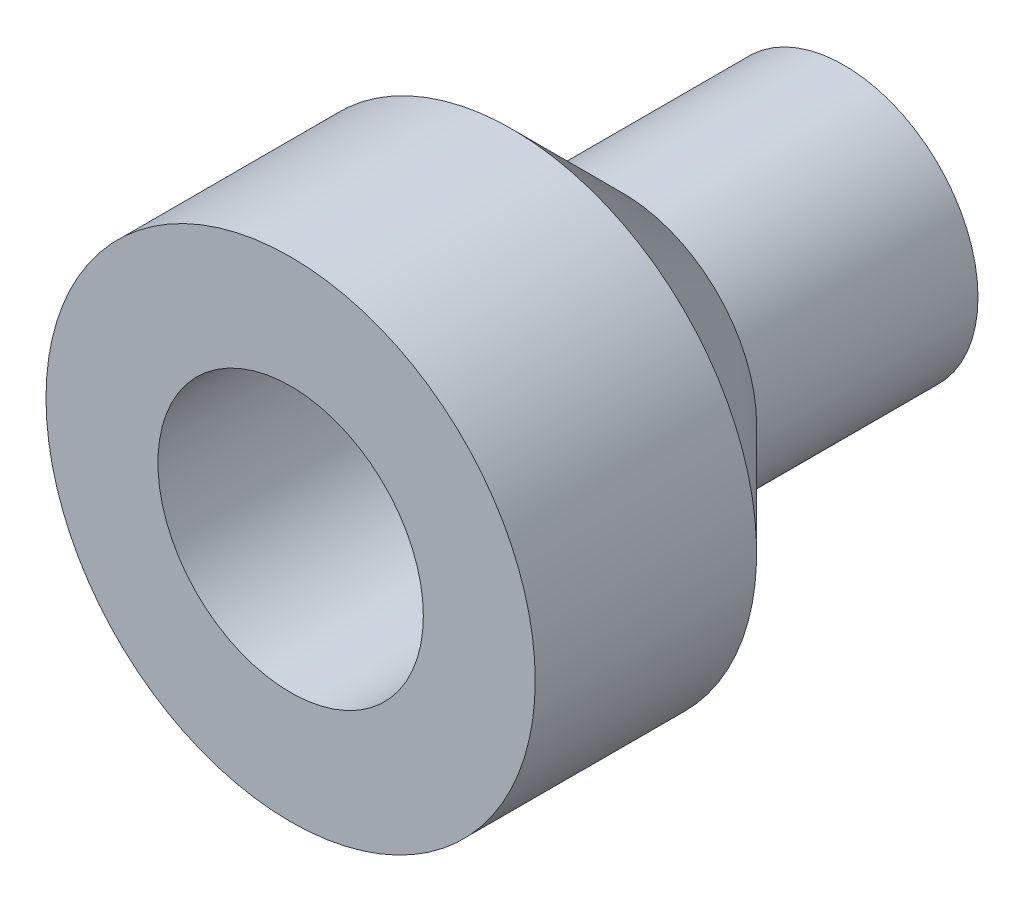
ISO-10303-21;
HEADER;
FILE_DESCRIPTION(('STEP AP214'),'2;1');
FILE_NAME('part.step','',(''),(''),'','','');
FILE_SCHEMA(('AUTOMOTIVE_DESIGN { 1 0 10303 214 1 1 1 1 }'));
ENDSEC;
DATA;
#1=APPLICATION_CONTEXT('core data for automotive mechanical design processes');
#2=APPLICATION_PROTOCOL_DEFINITION('international standard','automotive_design',2000,#1);
#3=PRODUCT_CONTEXT('',#1,'mechanical');
#4=PRODUCT('Part','Part','',(#3));
#5=PRODUCT_RELATED_PRODUCT_CATEGORY('part','',(#4));
#6=PRODUCT_DEFINITION_FORMATION('','',#4);
#7=PRODUCT_DEFINITION_CONTEXT('part definition',#1,'design');
#8=PRODUCT_DEFINITION('design','',#6,#7);
#9=PRODUCT_DEFINITION_SHAPE('','',#8);
#10=(LENGTH_UNIT() NAMED_UNIT(*) SI_UNIT(.MILLI.,.METRE.));
#11=(NAMED_UNIT(*) PLANE_ANGLE_UNIT() SI_UNIT($,.RADIAN.));
#12=(NAMED_UNIT(*) SI_UNIT($,.STERADIAN.) SOLID_ANGLE_UNIT());
#13=UNCERTAINTY_MEASURE_WITH_UNIT(LENGTH_MEASURE(1.E-05),#10,'distance_accuracy_value','');
#14=(GEOMETRIC_REPRESENTATION_CONTEXT(3) GLOBAL_UNCERTAINTY_ASSIGNED_CONTEXT((#13)) GLOBAL_UNIT_ASSIGNED_CONTEXT((#10,
#11,#12)) REPRESENTATION_CONTEXT('',''));
#15=CARTESIAN_POINT('',(0.,0.,0.));
#16=DIRECTION('',(0.,0.,1.));
#17=DIRECTION('',(1.,0.,0.));
#18=AXIS2_PLACEMENT_3D('',#15,#16,#17);
#19=CARTESIAN_POINT('',(0.,0.,10.));
#20=DIRECTION('',(0.,0.,1.));
#21=DIRECTION('',(1.,0.,0.));
#22=AXIS2_PLACEMENT_3D('',#19,#20,#21);
#23=PLANE('',#22);
#24=CARTESIAN_POINT('',(0.,0.,10.));
#25=DIRECTION('',(0.,0.,1.));
#26=DIRECTION('',(1.,0.,0.));
#27=AXIS2_PLACEMENT_3D('',#24,#25,#26);
#28=CIRCLE('',#27,11.05);
#29=CARTESIAN_POINT('',(11.05,0.,10.));
#30=VERTEX_POINT('',#29);
#31=EDGE_CURVE('E45',#30,#30,#28,.T.);
#32=ORIENTED_EDGE('',*,*,#31,.T.);
#33=EDGE_LOOP('',(#32));
#34=FACE_BOUND('',#33,.T.);
#35=CARTESIAN_POINT('',(0.,0.,10.));
#36=DIRECTION('',(0.,0.,1.));
#37=DIRECTION('',(1.,0.,0.));
#38=AXIS2_PLACEMENT_3D('',#35,#36,#37);
#39=CIRCLE('',#38,5.995);
#40=CARTESIAN_POINT('',(5.995,0.,10.));
#41=VERTEX_POINT('',#40);
#42=EDGE_CURVE('E57',#41,#41,#39,.T.);
#43=ORIENTED_EDGE('',*,*,#42,.F.);
#44=EDGE_LOOP('',(#43));
#45=FACE_BOUND('',#44,.T.);
#46=ADVANCED_FACE('F33',(#34,#45),#23,.T.);
#47=CARTESIAN_POINT('',(0.,0.,10.));
#48=DIRECTION('',(0.,0.,-1.));
#49=DIRECTION('',(-1.,0.,0.));
#50=AXIS2_PLACEMENT_3D('',#47,#48,#49);
#51=CYLINDRICAL_SURFACE('',#50,11.05);
#52=CARTESIAN_POINT('',(0.,0.,0.));
#53=DIRECTION('',(0.,0.,-1.));
#54=DIRECTION('',(-1.,0.,0.));
#55=AXIS2_PLACEMENT_3D('',#52,#53,#54);
#56=CIRCLE('',#55,11.05);
#57=CARTESIAN_POINT('',(-11.05,0.,0.));
#58=VERTEX_POINT('',#57);
#59=EDGE_CURVE('E41',#58,#58,#56,.F.);
#60=ORIENTED_EDGE('',*,*,#59,.T.);
#61=EDGE_LOOP('',(#60));
#62=FACE_BOUND('',#61,.T.);
#63=ORIENTED_EDGE('',*,*,#31,.F.);
#64=EDGE_LOOP('',(#63));
#65=FACE_BOUND('',#64,.T.);
#66=ADVANCED_FACE('F64',(#62,#65),#51,.T.);
#67=CARTESIAN_POINT('',(0.,0.,-15.));
#68=DIRECTION('',(0.,0.,1.));
#69=DIRECTION('',(1.,0.,0.));
#70=AXIS2_PLACEMENT_3D('',#67,#68,#69);
#71=CYLINDRICAL_SURFACE('',#70,6.05);
#72=CARTESIAN_POINT('',(0.,0.,-5.));
#73=DIRECTION('',(0.,0.,-1.));
#74=DIRECTION('',(-1.,0.,0.));
#75=AXIS2_PLACEMENT_3D('',#72,#73,#74);
#76=CIRCLE('',#75,6.05);
#77=CARTESIAN_POINT('',(-6.05,0.,-5.));
#78=VERTEX_POINT('',#77);
#79=EDGE_CURVE('E49',#78,#78,#76,.F.);
#80=ORIENTED_EDGE('',*,*,#79,.F.);
#81=EDGE_LOOP('',(#80));
#82=FACE_BOUND('',#81,.T.);
#83=CARTESIAN_POINT('',(0.,0.,-15.));
#84=DIRECTION('',(0.,0.,-1.));
#85=DIRECTION('',(-1.,0.,0.));
#86=AXIS2_PLACEMENT_3D('',#83,#84,#85);
#87=CIRCLE('',#86,6.05);
#88=CARTESIAN_POINT('',(-6.05,0.,-15.));
#89=VERTEX_POINT('',#88);
#90=EDGE_CURVE('E53',#89,#89,#87,.T.);
#91=ORIENTED_EDGE('',*,*,#90,.F.);
#92=EDGE_LOOP('',(#91));
#93=FACE_BOUND('',#92,.T.);
#94=ADVANCED_FACE('F72',(#82,#93),#71,.T.);
#95=CARTESIAN_POINT('',(0.,0.,-15.));
#96=DIRECTION('',(0.,0.,-1.));
#97=DIRECTION('',(-1.,0.,0.));
#98=AXIS2_PLACEMENT_3D('',#95,#96,#97);
#99=PLANE('',#98);
#100=ORIENTED_EDGE('',*,*,#90,.T.);
#101=EDGE_LOOP('',(#100));
#102=FACE_BOUND('',#101,.T.);
#103=ADVANCED_FACE('F80',(#102),#99,.T.);
#104=CARTESIAN_POINT('',(0.,0.,-5.));
#105=DIRECTION('',(0.,0.,1.));
#106=DIRECTION('',(1.,0.,0.));
#107=AXIS2_PLACEMENT_3D('',#104,#105,#106);
#108=CONICAL_SURFACE('',#107,6.05000000000001,0.785398163397447);
#109=ORIENTED_EDGE('',*,*,#59,.F.);
#110=EDGE_LOOP('',(#109));
#111=FACE_BOUND('',#110,.T.);
#112=ORIENTED_EDGE('',*,*,#79,.T.);
#113=EDGE_LOOP('',(#112));
#114=FACE_BOUND('',#113,.T.);
#115=ADVANCED_FACE('F36',(#111,#114),#108,.T.);
#116=CARTESIAN_POINT('',(0.,0.,0.));
#117=DIRECTION('',(0.,0.,1.));
#118=DIRECTION('',(1.,0.,0.));
#119=AXIS2_PLACEMENT_3D('',#116,#117,#118);
#120=CYLINDRICAL_SURFACE('',#119,5.995);
#121=CARTESIAN_POINT('',(0.,0.,0.));
#122=DIRECTION('',(0.,0.,-1.));
#123=DIRECTION('',(-1.,0.,0.));
#124=AXIS2_PLACEMENT_3D('',#121,#122,#123);
#125=CIRCLE('',#124,5.995);
#126=CARTESIAN_POINT('',(-5.995,0.,0.));
#127=VERTEX_POINT('',#126);
#128=EDGE_CURVE('E10',#127,#127,#125,.T.);
#129=ORIENTED_EDGE('',*,*,#128,.T.);
#130=EDGE_LOOP('',(#129));
#131=FACE_BOUND('',#130,.T.);
#132=ORIENTED_EDGE('',*,*,#42,.T.);
#133=EDGE_LOOP('',(#132));
#134=FACE_BOUND('',#133,.T.);
#135=ADVANCED_FACE('F61',(#131,#134),#120,.F.);
#136=CARTESIAN_POINT('',(0.,0.,0.));
#137=DIRECTION('',(0.,0.,-1.));
#138=DIRECTION('',(-1.,0.,0.));
#139=AXIS2_PLACEMENT_3D('',#136,#137,#138);
#140=PLANE('',#139);
#141=ORIENTED_EDGE('',*,*,#128,.F.);
#142=EDGE_LOOP('',(#141));
#143=FACE_BOUND('',#142,.T.);
#144=ADVANCED_FACE('F74',(#143),#140,.F.);
#145=CLOSED_SHELL('',(#46,#66,#94,#103,#115,#135,#144));
#146=MANIFOLD_SOLID_BREP('B2',#145);
#147=ADVANCED_BREP_SHAPE_REPRESENTATION('',(#18,#146),#14);
#148=SHAPE_DEFINITION_REPRESENTATION(#9,#147);
ENDSEC;
END-ISO-10303-21;
